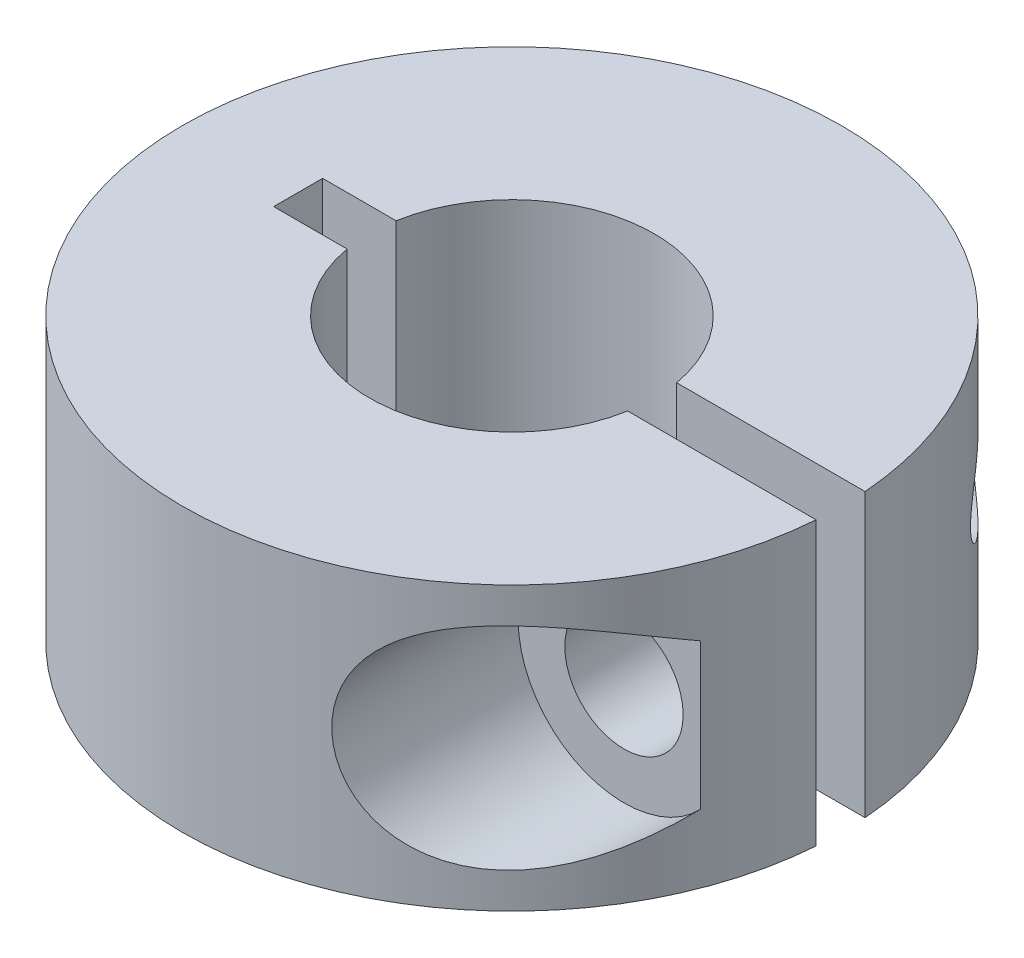
ISO-10303-21;
HEADER;
FILE_DESCRIPTION(('STEP AP214'),'2;1');
FILE_NAME('part.step','',(''),(''),'','','');
FILE_SCHEMA(('AUTOMOTIVE_DESIGN { 1 0 10303 214 1 1 1 1 }'));
ENDSEC;
DATA;
#1=APPLICATION_CONTEXT('core data for automotive mechanical design processes');
#2=APPLICATION_PROTOCOL_DEFINITION('international standard','automotive_design',2000,#1);
#3=PRODUCT_CONTEXT('',#1,'mechanical');
#4=PRODUCT('Part','Part','',(#3));
#5=PRODUCT_RELATED_PRODUCT_CATEGORY('part','',(#4));
#6=PRODUCT_DEFINITION_FORMATION('','',#4);
#7=PRODUCT_DEFINITION_CONTEXT('part definition',#1,'design');
#8=PRODUCT_DEFINITION('design','',#6,#7);
#9=PRODUCT_DEFINITION_SHAPE('','',#8);
#10=(LENGTH_UNIT() NAMED_UNIT(*) SI_UNIT(.MILLI.,.METRE.));
#11=(NAMED_UNIT(*) PLANE_ANGLE_UNIT() SI_UNIT($,.RADIAN.));
#12=(NAMED_UNIT(*) SI_UNIT($,.STERADIAN.) SOLID_ANGLE_UNIT());
#13=UNCERTAINTY_MEASURE_WITH_UNIT(LENGTH_MEASURE(1.E-05),#10,'distance_accuracy_value','');
#14=(GEOMETRIC_REPRESENTATION_CONTEXT(3) GLOBAL_UNCERTAINTY_ASSIGNED_CONTEXT((#13)) GLOBAL_UNIT_ASSIGNED_CONTEXT((#10,
#11,#12)) REPRESENTATION_CONTEXT('',''));
#15=CARTESIAN_POINT('',(0.,0.,0.));
#16=DIRECTION('',(0.,0.,1.));
#17=DIRECTION('',(1.,0.,0.));
#18=AXIS2_PLACEMENT_3D('',#15,#16,#17);
#19=CARTESIAN_POINT('',(7.77979615405373,4.7625,51.6255));
#20=DIRECTION('',(0.,0.,-1.));
#21=DIRECTION('',(-1.,0.,0.));
#22=AXIS2_PLACEMENT_3D('',#19,#20,#21);
#23=CYLINDRICAL_SURFACE('',#22,1.9939);
#24=CARTESIAN_POINT('',(7.77979615405373,4.7625,4.0005));
#25=DIRECTION('',(0.,0.,-1.));
#26=DIRECTION('',(-1.,0.,0.));
#27=AXIS2_PLACEMENT_3D('',#24,#25,#26);
#28=CIRCLE('',#27,1.9939);
#29=CARTESIAN_POINT('',(5.78589615405373,4.7625,4.0005));
#30=VERTEX_POINT('',#29);
#31=EDGE_CURVE('E20',#30,#30,#28,.F.);
#32=ORIENTED_EDGE('',*,*,#31,.T.);
#33=EDGE_LOOP('',(#32));
#34=FACE_BOUND('',#33,.T.);
#35=CARTESIAN_POINT('',(7.77979615405373,4.7625,0.8255));
#36=DIRECTION('',(0.,0.,-1.));
#37=DIRECTION('',(-1.,0.,0.));
#38=AXIS2_PLACEMENT_3D('',#35,#36,#37);
#39=CIRCLE('',#38,1.9939);
#40=CARTESIAN_POINT('',(5.78589615405373,4.7625,0.8255));
#41=VERTEX_POINT('',#40);
#42=EDGE_CURVE('E85',#41,#41,#39,.T.);
#43=ORIENTED_EDGE('',*,*,#42,.T.);
#44=EDGE_LOOP('',(#43));
#45=FACE_BOUND('',#44,.T.);
#46=ADVANCED_FACE('F17',(#34,#45),#23,.F.);
#47=CARTESIAN_POINT('',(-7.20620384594627,9.525,-0.8255));
#48=DIRECTION('',(-1.,0.,0.));
#49=DIRECTION('',(0.,0.,1.));
#50=AXIS2_PLACEMENT_3D('',#47,#48,#49);
#51=PLANE('',#50);
#52=DIRECTION('',(0.,1.,0.));
#53=VECTOR('',#52,1.);
#54=CARTESIAN_POINT('',(-7.20620384594627,9.525,-0.825500000000001));
#55=LINE('',#54,#53);
#56=CARTESIAN_POINT('',(-7.20620384594627,0.,-0.8255));
#57=VERTEX_POINT('',#56);
#58=CARTESIAN_POINT('',(-7.20620384594627,9.525,-0.8255));
#59=VERTEX_POINT('',#58);
#60=EDGE_CURVE('E102',#57,#59,#55,.T.);
#61=ORIENTED_EDGE('',*,*,#60,.T.);
#62=DIRECTION('',(0.,0.,1.));
#63=VECTOR('',#62,1.);
#64=CARTESIAN_POINT('',(-7.20620384594627,9.525,-0.8255));
#65=LINE('',#64,#63);
#66=CARTESIAN_POINT('',(-7.20620384594627,9.525,0.825499999999998));
#67=VERTEX_POINT('',#66);
#68=EDGE_CURVE('E128',#67,#59,#65,.F.);
#69=ORIENTED_EDGE('',*,*,#68,.F.);
#70=DIRECTION('',(0.,1.,0.));
#71=VECTOR('',#70,1.);
#72=CARTESIAN_POINT('',(-7.20620384594627,9.525,0.825499999999998));
#73=LINE('',#72,#71);
#74=CARTESIAN_POINT('',(-7.20620384594627,0.,0.825499999999998));
#75=VERTEX_POINT('',#74);
#76=EDGE_CURVE('E109',#67,#75,#73,.F.);
#77=ORIENTED_EDGE('',*,*,#76,.T.);
#78=DIRECTION('',(0.,0.,1.));
#79=VECTOR('',#78,1.);
#80=CARTESIAN_POINT('',(-7.20620384594627,0.,-0.8255));
#81=LINE('',#80,#79);
#82=EDGE_CURVE('E125',#57,#75,#81,.T.);
#83=ORIENTED_EDGE('',*,*,#82,.F.);
#84=EDGE_LOOP('',(#61,#69,#77,#83));
#85=FACE_BOUND('',#84,.T.);
#86=ADVANCED_FACE('F171',(#85),#51,.F.);
#87=CARTESIAN_POINT('',(7.77979615405373,4.7625,4.0005));
#88=DIRECTION('',(0.,0.,-1.));
#89=DIRECTION('',(-1.,0.,0.));
#90=AXIS2_PLACEMENT_3D('',#87,#88,#89);
#91=PLANE('',#90);
#92=DIRECTION('',(0.,-1.,0.));
#93=VECTOR('',#92,1.);
#94=CARTESIAN_POINT('',(10.3674324690349,9.525,4.0005));
#95=LINE('',#94,#93);
#96=CARTESIAN_POINT('',(10.3674324690349,7.22009190904235,4.0005));
#97=VERTEX_POINT('',#96);
#98=CARTESIAN_POINT('',(10.3674324690349,2.30490809095765,4.0005));
#99=VERTEX_POINT('',#98);
#100=EDGE_CURVE('E77',#97,#99,#95,.T.);
#101=ORIENTED_EDGE('',*,*,#100,.F.);
#102=CARTESIAN_POINT('',(7.77979615405373,4.7625,4.0005));
#103=DIRECTION('',(0.,0.,-1.));
#104=DIRECTION('',(-1.,0.,0.));
#105=AXIS2_PLACEMENT_3D('',#102,#103,#104);
#106=CIRCLE('',#105,3.5687);
#107=EDGE_CURVE('E79',#97,#99,#106,.F.);
#108=ORIENTED_EDGE('',*,*,#107,.T.);
#109=EDGE_LOOP('',(#101,#108));
#110=FACE_BOUND('',#109,.T.);
#111=ORIENTED_EDGE('',*,*,#31,.F.);
#112=EDGE_LOOP('',(#111));
#113=FACE_BOUND('',#112,.T.);
#114=ADVANCED_FACE('F81',(#110,#113),#91,.F.);
#115=CARTESIAN_POINT('',(7.77979615405373,4.7625,11.1125));
#116=DIRECTION('',(0.,0.,-1.));
#117=DIRECTION('',(-1.,0.,0.));
#118=AXIS2_PLACEMENT_3D('',#115,#116,#117);
#119=CYLINDRICAL_SURFACE('',#118,3.5687);
#120=CARTESIAN_POINT('',(10.3674324690349,2.30490809095765,4.0005));
#121=CARTESIAN_POINT('',(10.2663669239335,2.19847959541599,4.26230224821174));
#122=CARTESIAN_POINT('',(10.1550425392723,2.09444652602234,4.52137700738966));
#123=CARTESIAN_POINT('',(9.91083423240438,1.89558467643553,5.03431334383161));
#124=CARTESIAN_POINT('',(9.7778592183075,1.8007976161063,5.2881475535187));
#125=CARTESIAN_POINT('',(9.48799793007862,1.62452313443331,5.79234836702928));
#126=CARTESIAN_POINT('',(9.33078063634742,1.54325837689086,6.042604576959));
#127=CARTESIAN_POINT('',(8.99395347939697,1.40173632453196,6.53335445131245));
#128=CARTESIAN_POINT('',(8.81439006664557,1.34143640914698,6.77386703363101));
#129=CARTESIAN_POINT('',(8.52916651119161,1.27200319506489,7.12485875216284));
#130=CARTESIAN_POINT('',(8.43167972628431,1.25238202422405,7.23998139033188));
#131=CARTESIAN_POINT('',(8.23150314272245,1.22105313992744,7.46678445643854));
#132=CARTESIAN_POINT('',(8.1288130467734,1.20934587918725,7.57846468710437));
#133=CARTESIAN_POINT('',(7.91905409389861,1.19497531618115,7.79737953687186));
#134=CARTESIAN_POINT('',(7.81200495166688,1.19227506955817,7.90463052966583));
#135=CARTESIAN_POINT('',(7.59371464897207,1.19698376693025,8.11455885658455));
#136=CARTESIAN_POINT('',(7.48247425347248,1.20439087479674,8.21723701792306));
#137=CARTESIAN_POINT('',(7.27484741086238,1.22841788622605,8.40120666156685));
#138=CARTESIAN_POINT('',(7.17895742835564,1.24336004979494,8.48327737734031));
#139=CARTESIAN_POINT('',(6.98549160847407,1.28192181193209,8.64328119369291));
#140=CARTESIAN_POINT('',(6.88791613303347,1.30553956908936,8.72121516828857));
#141=CARTESIAN_POINT('',(6.69192650438771,1.36212348411486,8.87249106272569));
#142=CARTESIAN_POINT('',(6.5935124940477,1.3950880792322,8.94583374771056));
#143=CARTESIAN_POINT('',(6.39688046982801,1.47095603467606,9.08747753024267));
#144=CARTESIAN_POINT('',(6.29866242359396,1.513857588604,9.15577954114102));
#145=CARTESIAN_POINT('',(6.12046763513868,1.60174888476471,9.27561321156923));
#146=CARTESIAN_POINT('',(6.04026323206984,1.64510575470385,9.3280069229299));
#147=CARTESIAN_POINT('',(5.88163789457942,1.73907332052905,9.42882912499201));
#148=CARTESIAN_POINT('',(5.80321664489981,1.78968272244453,9.47725832061136));
#149=CARTESIAN_POINT('',(5.64900919954521,1.89819302718989,9.56997634046226));
#150=CARTESIAN_POINT('',(5.57322292596697,1.95609371421807,9.61426528716605));
#151=CARTESIAN_POINT('',(5.4252198105476,2.07906172069284,9.69855124417801));
#152=CARTESIAN_POINT('',(5.35300129595211,2.14412563454233,9.73855027632651));
#153=CARTESIAN_POINT('',(5.21265818259072,2.28154951917683,9.81438978299457));
#154=CARTESIAN_POINT('',(5.14455599507122,2.35394453145642,9.85020833585232));
#155=CARTESIAN_POINT('',(5.01378027806257,2.50533880258088,9.91741239005637));
#156=CARTESIAN_POINT('',(4.95110451871958,2.5843353222254,9.94879971567963));
#157=CARTESIAN_POINT('',(4.83197655089795,2.7484818722511,10.0072006298196));
#158=CARTESIAN_POINT('',(4.77552784937671,2.83363532586194,10.0342117577197));
#159=CARTESIAN_POINT('',(4.66968255156178,3.00940695388714,10.0839050896206));
#160=CARTESIAN_POINT('',(4.62028522054457,3.10002455755817,10.1065877447134));
#161=CARTESIAN_POINT('',(4.53305156514435,3.27816052527519,10.1459940207608));
#162=CARTESIAN_POINT('',(4.4945925743953,3.36529949525515,10.1630582106346));
#163=CARTESIAN_POINT('',(4.42460442827421,3.54290304454181,10.1937232105687));
#164=CARTESIAN_POINT('',(4.39307478789183,3.63336739057569,10.2073242630371));
#165=CARTESIAN_POINT('',(4.33735537673633,3.81677762480408,10.2311251434094));
#166=CARTESIAN_POINT('',(4.31315211523552,3.90971860477992,10.2413312262512));
#167=CARTESIAN_POINT('',(4.27228604299165,4.0975025392839,10.2584462513805));
#168=CARTESIAN_POINT('',(4.25561994490492,4.19234464574727,10.2653566311652));
#169=CARTESIAN_POINT('',(4.23226471995796,4.36636343023717,10.2750047277462));
#170=CARTESIAN_POINT('',(4.22433286345768,4.44534623447247,10.2782640608988));
#171=CARTESIAN_POINT('',(4.21374608112229,4.60370610770911,10.2826077289471));
#172=CARTESIAN_POINT('',(4.21109112844074,4.68308317470257,10.2836920749081));
#173=CARTESIAN_POINT('',(4.21110795467778,4.94897836640286,10.2836925209088));
#174=CARTESIAN_POINT('',(4.22578569721786,5.13567594248044,10.2777149649096));
#175=CARTESIAN_POINT('',(4.28397599741145,5.50393941773717,10.2535923667797));
#176=CARTESIAN_POINT('',(4.32754043196438,5.68549547060415,10.2354254333466));
#177=CARTESIAN_POINT('',(4.44165490623085,6.03791028227731,10.1864216470968));
#178=CARTESIAN_POINT('',(4.51217532606613,6.20878054393041,10.1555986982627));
#179=CARTESIAN_POINT('',(4.67714722696151,6.535247570976,10.0806800129494));
#180=CARTESIAN_POINT('',(4.771587674735,6.69085133236821,10.03659039406));
#181=CARTESIAN_POINT('',(4.98130360475947,6.98441429175627,9.93418167292039));
#182=CARTESIAN_POINT('',(5.09676685797358,7.12219359415009,9.87573252197954));
#183=CARTESIAN_POINT('',(5.34291515503719,7.37563229639414,9.74475841110709));
#184=CARTESIAN_POINT('',(5.47360279054515,7.49128792123418,9.67223105322721));
#185=CARTESIAN_POINT('',(5.75187719093284,7.70451693085491,9.50951251052659));
#186=CARTESIAN_POINT('',(5.89998752702557,7.8008533576798,9.41860434778593));
#187=CARTESIAN_POINT('',(6.20144537979583,7.96783244118789,9.22290703360076));
#188=CARTESIAN_POINT('',(6.35479572215133,8.03846098783399,9.11811030218263));
#189=CARTESIAN_POINT('',(6.61464262506999,8.13756072006862,8.93036839954114));
#190=CARTESIAN_POINT('',(6.72109839524481,8.17231824265645,8.85056642852618));
#191=CARTESIAN_POINT('',(6.93291796581742,8.2309997980135,8.68563789853114));
#192=CARTESIAN_POINT('',(7.03828142208256,8.25492051227578,8.60050971760008));
#193=CARTESIAN_POINT('',(7.24692582861338,8.29278705004218,8.42545512554879));
#194=CARTESIAN_POINT('',(7.35020473617683,8.30672351095785,8.33552429548874));
#195=CARTESIAN_POINT('',(7.55381938185991,8.32550584447609,8.15146118083268));
#196=CARTESIAN_POINT('',(7.65415427968448,8.33034914603401,8.05732771566287));
#197=CARTESIAN_POINT('',(7.89029287987062,8.33214149466807,7.82737352779086));
#198=CARTESIAN_POINT('',(8.02442243549549,8.32520873112519,7.68979558622367));
#199=CARTESIAN_POINT('',(8.28473874045248,8.29772232559945,7.40861117656735));
#200=CARTESIAN_POINT('',(8.41092206999899,8.27716286242626,7.26500215662964));
#201=CARTESIAN_POINT('',(8.65521331719172,8.22442705946524,6.97219028142885));
#202=CARTESIAN_POINT('',(8.77328753514642,8.19220536465628,6.82296765331261));
#203=CARTESIAN_POINT('',(9.00051785282219,8.11805359850228,6.52028783506779));
#204=CARTESIAN_POINT('',(9.10967518427914,8.07612487111847,6.36683123373096));
#205=CARTESIAN_POINT('',(9.33399320618012,7.97764616263796,6.03407352995808));
#206=CARTESIAN_POINT('',(9.44778095845141,7.91986281999941,5.85421416860254));
#207=CARTESIAN_POINT('',(9.66374959882742,7.79595404338297,5.49038916371615));
#208=CARTESIAN_POINT('',(9.76592600628248,7.72982540971263,5.30642196757501));
#209=CARTESIAN_POINT('',(9.95763815605561,7.59205473634197,4.93719299017159));
#210=CARTESIAN_POINT('',(10.0473122671133,7.52048935423043,4.75197402105144));
#211=CARTESIAN_POINT('',(10.2155862178225,7.37306629497145,4.37850078748289));
#212=CARTESIAN_POINT('',(10.2941977253124,7.29721326026375,4.19024995796826));
#213=CARTESIAN_POINT('',(10.3674324690349,7.22009190904235,4.0005));
#214=B_SPLINE_CURVE_WITH_KNOTS('',3,(#120,#121,#122,#123,#124,#125,#126,#127,#128,#129,#130,
#131,#132,#133,#134,#135,#136,#137,#138,#139,#140,#141,#142,#143,#144,#145,#146,#147,#148,#149,
#150,#151,#152,#153,#154,#155,#156,#157,#158,#159,#160,#161,#162,#163,#164,#165,#166,#167,#168,
#169,#170,#171,#172,#173,#174,#175,#176,#177,#178,#179,#180,#181,#182,#183,#184,#185,#186,#187,
#188,#189,#190,#191,#192,#193,#194,#195,#196,#197,#198,#199,#200,#201,#202,#203,#204,#205,#206,
#207,#208,#209,#210,#211,#212,#213),.UNSPECIFIED.,.F.,.F.,(4,2,2,2,2,2,2,2,2,2,2,2,2,2,2,2,2,2,
2,2,2,2,2,2,2,2,2,2,2,2,2,2,2,2,2,2,2,2,2,2,2,2,2,2,2,2,4),(0.,0.900564757805945,
1.80502136618994,2.72314796339463,3.63939698466883,4.09549870479075,4.55162651402446,
5.00588109345266,5.46005316278619,5.84100641610331,6.22187885805555,6.60268765729432,
6.98342728513403,7.29857796486122,7.61367248638466,7.9287576841804,8.24369372337746,
8.56021334571762,8.8766022787887,9.19316849592317,9.50970170405786,9.79963744700581,
10.0895528898323,10.378931191199,10.6681831578316,10.9063127947884,11.1444412202491,
11.7035897332714,12.2637451368956,12.8232867896403,13.3825708182631,13.9471199344566,
14.5117652951076,15.1054705931551,15.6995012628969,16.1115195263262,16.5236638751068,
16.9361942021713,17.3488411525354,17.9247618490849,18.5009287319273,19.079360867783,
19.657712966208,20.3187524451641,20.9800461496471,21.6333137153044,22.2858870245931),.UNSPECIFIED.);
#215=EDGE_CURVE('E86',#99,#97,#214,.T.);
#216=ORIENTED_EDGE('',*,*,#215,.F.);
#217=ORIENTED_EDGE('',*,*,#107,.F.);
#218=EDGE_LOOP('',(#216,#217));
#219=FACE_BOUND('',#218,.T.);
#220=ADVANCED_FACE('F87',(#219),#119,.F.);
#221=CARTESIAN_POINT('',(7.77979615405373,4.7625,-0.8255));
#222=DIRECTION('',(0.,0.,1.));
#223=DIRECTION('',(1.,0.,0.));
#224=AXIS2_PLACEMENT_3D('',#221,#222,#223);
#225=CYLINDRICAL_SURFACE('',#224,1.35255);
#226=CARTESIAN_POINT('',(7.77979615405373,4.7625,-0.8255));
#227=DIRECTION('',(0.,0.,1.));
#228=DIRECTION('',(1.,0.,0.));
#229=AXIS2_PLACEMENT_3D('',#226,#227,#228);
#230=CIRCLE('',#229,1.35255);
#231=CARTESIAN_POINT('',(9.13234615405373,4.7625,-0.8255));
#232=VERTEX_POINT('',#231);
#233=EDGE_CURVE('E94',#232,#232,#230,.T.);
#234=ORIENTED_EDGE('',*,*,#233,.T.);
#235=EDGE_LOOP('',(#234));
#236=FACE_BOUND('',#235,.T.);
#237=CARTESIAN_POINT('',(6.42724615405373,4.7625,-9.06521721334914));
#238=CARTESIAN_POINT('',(6.42725051386567,4.69729349686207,-9.06521484293327));
#239=CARTESIAN_POINT('',(6.43199350127272,4.63202157832079,-9.06185711492394));
#240=CARTESIAN_POINT('',(6.45069191620245,4.50344595016543,-9.04855539866578));
#241=CARTESIAN_POINT('',(6.46466183296176,4.44014550036516,-9.0386010515284));
#242=CARTESIAN_POINT('',(6.50092320383923,4.31759160728634,-9.01255485878856));
#243=CARTESIAN_POINT('',(6.52318363929626,4.25832404064418,-8.9964858860175));
#244=CARTESIAN_POINT('',(6.57484760370806,4.14494375784632,-8.95879753024897));
#245=CARTESIAN_POINT('',(6.60425040670855,4.09083051857953,-8.93717871132833));
#246=CARTESIAN_POINT('',(6.67063488166069,3.98582881279454,-8.88774904651376));
#247=CARTESIAN_POINT('',(6.70794211744733,3.93527651174348,-8.85966508072131));
#248=CARTESIAN_POINT('',(6.78747920384551,3.8413630691107,-8.79888039649585));
#249=CARTESIAN_POINT('',(6.82971175743175,3.7980059080863,-8.76617714093555));
#250=CARTESIAN_POINT('',(6.93676010891622,3.70142298187185,-8.68190118433547));
#251=CARTESIAN_POINT('',(7.00344470181075,3.65203648929477,-8.62828384778057));
#252=CARTESIAN_POINT('',(7.14073644849573,3.56771355341513,-8.51501702408386));
#253=CARTESIAN_POINT('',(7.21135127376822,3.53280658097599,-8.45535553892394));
#254=CARTESIAN_POINT('',(7.37551318943355,3.4679311015023,-8.31291183464742));
#255=CARTESIAN_POINT('',(7.46955496557129,3.44262512131705,-8.22858230365518));
#256=CARTESIAN_POINT('',(7.65631122374983,3.41227231491982,-8.0551149771241));
#257=CARTESIAN_POINT('',(7.74902468780618,3.40724027675367,-7.96597371986675));
#258=CARTESIAN_POINT('',(7.93260916798154,3.41541354573241,-7.78321643189271));
#259=CARTESIAN_POINT('',(8.02341005844468,3.4289728153589,-7.68954723625733));
#260=CARTESIAN_POINT('',(8.19968317388684,3.47356030219008,-7.50130102913478));
#261=CARTESIAN_POINT('',(8.28515152044056,3.50460107311566,-7.40672341332664));
#262=CARTESIAN_POINT('',(8.44942044766132,3.58380523644829,-7.2187586651293));
#263=CARTESIAN_POINT('',(8.52821995893403,3.63197136861001,-7.12537172570496));
#264=CARTESIAN_POINT('',(8.63998573409417,3.71767615784216,-6.98869036675427));
#265=CARTESIAN_POINT('',(8.67615377407723,3.74846998189495,-6.94371607978802));
#266=CARTESIAN_POINT('',(8.74605600129952,3.81484141376245,-6.85545895202343));
#267=CARTESIAN_POINT('',(8.77979173706973,3.85041593586811,-6.81217504323436));
#268=CARTESIAN_POINT('',(8.84822446653481,3.93124697101413,-6.72310139290578));
#269=CARTESIAN_POINT('',(8.88256560367972,3.97715053621501,-6.67761815116879));
#270=CARTESIAN_POINT('',(8.94671882683973,4.07609415299266,-6.59141503649058));
#271=CARTESIAN_POINT('',(8.97653613143118,4.12912584642951,-6.55068968763795));
#272=CARTESIAN_POINT('',(9.02413858316114,4.2301630108557,-6.48489372352669));
#273=CARTESIAN_POINT('',(9.04312288963765,4.27663441520166,-6.45835974793269));
#274=CARTESIAN_POINT('',(9.07642350940675,4.3741796244611,-6.41147565479932));
#275=CARTESIAN_POINT('',(9.09074655481073,4.42524665465929,-6.39111662190494));
#276=CARTESIAN_POINT('',(9.11189317766656,4.52362204236662,-6.36092392853074));
#277=CARTESIAN_POINT('',(9.11949729227643,4.5704204080861,-6.35000007263481));
#278=CARTESIAN_POINT('',(9.12972046055373,4.66564881286231,-6.33529363301747));
#279=CARTESIAN_POINT('',(9.13234539300947,4.71407685892571,-6.33150262777137));
#280=CARTESIAN_POINT('',(9.13234687992863,4.80868541243554,-6.33150022809278));
#281=CARTESIAN_POINT('',(9.12996036660318,4.85486636274554,-6.33494666079501));
#282=CARTESIAN_POINT('',(9.12064861883045,4.94580601817767,-6.34834536910189));
#283=CARTESIAN_POINT('',(9.11371948751219,4.99056346755802,-6.35830323049691));
#284=CARTESIAN_POINT('',(9.09379705823402,5.08776384714079,-6.38677336002351));
#285=CARTESIAN_POINT('',(9.07976560932048,5.13956124776633,-6.40674010172869));
#286=CARTESIAN_POINT('',(9.04688637252221,5.23853352341446,-6.45308543877553));
#287=CARTESIAN_POINT('',(9.02802941255758,5.28569935609753,-6.47947623992327));
#288=CARTESIAN_POINT('',(8.97595077793867,5.3982563011822,-6.55154951354417));
#289=CARTESIAN_POINT('',(8.94031787518741,5.46061289369762,-6.60019071418336));
#290=CARTESIAN_POINT('',(8.86293577562621,5.57552900808703,-6.70374797266251));
#291=CARTESIAN_POINT('',(8.82117162335175,5.62806383913803,-6.75867929929566));
#292=CARTESIAN_POINT('',(8.74241168181125,5.71401790113332,-6.86010913097727));
#293=CARTESIAN_POINT('',(8.7063080195638,5.74912200450601,-6.90589671041646));
#294=CARTESIAN_POINT('',(8.63161664693339,5.81428424408298,-6.99903023188608));
#295=CARTESIAN_POINT('',(8.59302759569435,5.84433962443868,-7.04637700825023));
#296=CARTESIAN_POINT('',(8.47397082553645,5.92735869840442,-7.18991430882344));
#297=CARTESIAN_POINT('',(8.39021900051359,5.97316951776947,-7.28759464730287));
#298=CARTESIAN_POINT('',(8.21261217241913,6.0476731300518,-7.48727082827017));
#299=CARTESIAN_POINT('',(8.11849707570559,6.07566491749505,-7.58929191547064));
#300=CARTESIAN_POINT('',(7.92461045601931,6.11087205771957,-7.7915183956985));
#301=CARTESIAN_POINT('',(7.82484377910654,6.11810494367569,-7.89172524990992));
#302=CARTESIAN_POINT('',(7.63692594535757,6.11026691567303,-8.07338417519062));
#303=CARTESIAN_POINT('',(7.54922180102864,6.09831681045188,-8.15542865362084));
#304=CARTESIAN_POINT('',(7.37367944859783,6.0557877055756,-8.31447248364704));
#305=CARTESIAN_POINT('',(7.2858415242481,6.02523089222949,-8.39147772302125));
#306=CARTESIAN_POINT('',(7.13332888129076,5.95282456598946,-8.52120378744527));
#307=CARTESIAN_POINT('',(7.06796070483867,5.91517033115231,-8.57544454464142));
#308=CARTESIAN_POINT('',(6.94157826185632,5.82678720074208,-8.67806069428922));
#309=CARTESIAN_POINT('',(6.88055819444334,5.77607615783651,-8.726443963957));
#310=CARTESIAN_POINT('',(6.77641578746445,5.67189815713617,-8.80746188663116));
#311=CARTESIAN_POINT('',(6.73206430826271,5.62064641304644,-8.84135705377025));
#312=CARTESIAN_POINT('',(6.65020865381225,5.50960947750958,-8.90308983462969));
#313=CARTESIAN_POINT('',(6.6127050245321,5.44982360632608,-8.93092696538601));
#314=CARTESIAN_POINT('',(6.54640578590612,5.32227500006421,-8.97964052869189));
#315=CARTESIAN_POINT('',(6.51768312193646,5.25445161270734,-9.00045879313075));
#316=CARTESIAN_POINT('',(6.47142187614467,5.11325898109175,-9.03378020536473));
#317=CARTESIAN_POINT('',(6.45385452482184,5.03990455311158,-9.04630474624163));
#318=CARTESIAN_POINT('',(6.43745576965828,4.93181050820827,-9.05797162818181));
#319=CARTESIAN_POINT('',(6.4336352609791,4.89812573919876,-9.06068446573048));
#320=CARTESIAN_POINT('',(6.42852934971693,4.83046656739526,-9.06430785275542));
#321=CARTESIAN_POINT('',(6.42724388128229,4.79649217214779,-9.06521844904773));
#322=CARTESIAN_POINT('',(6.42724615405373,4.7625,-9.06521721334914));
#323=B_SPLINE_CURVE_WITH_KNOTS('',3,(#237,#238,#239,#240,#241,#242,#243,#244,#245,#246,#247,
#248,#249,#250,#251,#252,#253,#254,#255,#256,#257,#258,#259,#260,#261,#262,#263,#264,#265,#266,
#267,#268,#269,#270,#271,#272,#273,#274,#275,#276,#277,#278,#279,#280,#281,#282,#283,#284,#285,
#286,#287,#288,#289,#290,#291,#292,#293,#294,#295,#296,#297,#298,#299,#300,#301,#302,#303,#304,
#305,#306,#307,#308,#309,#310,#311,#312,#313,#314,#315,#316,#317,#318,#319,#320,#321,#322),
.UNSPECIFIED.,.T.,.F.,(4,2,2,2,2,2,2,2,2,2,2,2,2,2,2,2,2,2,2,2,2,2,2,2,2,2,2,2,2,2,2,2,2,2,2,2,
2,2,2,2,2,2,4),(0.,0.19548098576599,0.39126967149432,0.586333062397315,0.781376635236253,
0.987043357780296,1.19282348444301,1.48758278192446,1.78293910778627,2.16735056196091,
2.55204235955131,2.94416094901911,3.3365614842735,3.7290248249359,3.92507847308448,
4.12100618049771,4.3400407196027,4.55882063286583,4.72860526719673,4.89814358734956,
5.04338778730525,5.18846039428849,5.32682891062122,5.46531628155807,5.6361384888282,
5.80728782949306,6.06607486898029,6.32550397097796,6.52941671812134,6.73344041200314,
7.14151964298149,7.56479572302537,7.98771419452043,8.34849623051461,8.70884891650827,
8.98658368317371,9.26394069928591,9.49037741669735,9.71683217968527,9.94512000594052,
10.1728166618353,10.2747236130821,10.376627917101),.UNSPECIFIED.);
#324=CARTESIAN_POINT('',(6.42724615405373,4.7625,-9.06521721334914));
#325=VERTEX_POINT('',#324);
#326=EDGE_CURVE('E123',#325,#325,#323,.T.);
#327=ORIENTED_EDGE('',*,*,#326,.F.);
#328=EDGE_LOOP('',(#327));
#329=FACE_BOUND('',#328,.T.);
#330=ADVANCED_FACE('F151',(#236,#329),#225,.F.);
#331=CARTESIAN_POINT('',(4.69041106940533,9.525,0.825499999999997));
#332=DIRECTION('',(0.,0.,1.));
#333=DIRECTION('',(1.,0.,0.));
#334=AXIS2_PLACEMENT_3D('',#331,#332,#333);
#335=PLANE('',#334);
#336=DIRECTION('',(0.,1.,0.));
#337=VECTOR('',#336,1.);
#338=CARTESIAN_POINT('',(4.72909189062763,0.,0.825499999999998));
#339=LINE('',#338,#337);
#340=CARTESIAN_POINT('',(4.72909189062763,0.,0.825499999999998));
#341=VERTEX_POINT('',#340);
#342=CARTESIAN_POINT('',(4.72909189062763,9.525,0.825499999999998));
#343=VERTEX_POINT('',#342);
#344=EDGE_CURVE('E112',#341,#343,#339,.T.);
#345=ORIENTED_EDGE('',*,*,#344,.T.);
#346=DIRECTION('',(1.,0.,0.));
#347=VECTOR('',#346,1.);
#348=CARTESIAN_POINT('',(0.,9.525,0.825499999999998));
#349=LINE('',#348,#347);
#350=CARTESIAN_POINT('',(11.0817961540537,9.525,0.825499999999998));
#351=VERTEX_POINT('',#350);
#352=EDGE_CURVE('E202',#351,#343,#349,.F.);
#353=ORIENTED_EDGE('',*,*,#352,.F.);
#354=DIRECTION('',(0.,-1.,0.));
#355=VECTOR('',#354,1.);
#356=CARTESIAN_POINT('',(11.0817961540537,9.525,0.825499999999999));
#357=LINE('',#356,#355);
#358=CARTESIAN_POINT('',(11.0817961540537,0.,0.825499999999998));
#359=VERTEX_POINT('',#358);
#360=EDGE_CURVE('E89',#359,#351,#357,.F.);
#361=ORIENTED_EDGE('',*,*,#360,.F.);
#362=DIRECTION('',(1.,0.,0.));
#363=VECTOR('',#362,1.);
#364=CARTESIAN_POINT('',(0.,0.,0.825499999999998));
#365=LINE('',#364,#363);
#366=EDGE_CURVE('E142',#359,#341,#365,.F.);
#367=ORIENTED_EDGE('',*,*,#366,.T.);
#368=EDGE_LOOP('',(#345,#353,#361,#367));
#369=FACE_BOUND('',#368,.T.);
#370=ORIENTED_EDGE('',*,*,#42,.F.);
#371=EDGE_LOOP('',(#370));
#372=FACE_BOUND('',#371,.T.);
#373=ADVANCED_FACE('F221',(#369,#372),#335,.F.);
#374=CARTESIAN_POINT('',(0.,0.,0.));
#375=DIRECTION('',(0.,1.,0.));
#376=DIRECTION('',(0.,0.,1.));
#377=AXIS2_PLACEMENT_3D('',#374,#375,#376);
#378=CYLINDRICAL_SURFACE('',#377,4.8006);
#379=CARTESIAN_POINT('',(0.,0.,0.));
#380=DIRECTION('',(0.,1.,0.));
#381=DIRECTION('',(0.,0.,1.));
#382=AXIS2_PLACEMENT_3D('',#379,#380,#381);
#383=CIRCLE('',#382,4.8006);
#384=CARTESIAN_POINT('',(-4.72909189062763,0.,0.825499999999997));
#385=VERTEX_POINT('',#384);
#386=EDGE_CURVE('E139',#341,#385,#383,.F.);
#387=ORIENTED_EDGE('',*,*,#386,.T.);
#388=DIRECTION('',(0.,1.,0.));
#389=VECTOR('',#388,1.);
#390=CARTESIAN_POINT('',(-4.72909189062763,9.525,0.825499999999997));
#391=LINE('',#390,#389);
#392=CARTESIAN_POINT('',(-4.72909189062763,9.525,0.825499999999997));
#393=VERTEX_POINT('',#392);
#394=EDGE_CURVE('E105',#385,#393,#391,.T.);
#395=ORIENTED_EDGE('',*,*,#394,.T.);
#396=CARTESIAN_POINT('',(0.,9.525,0.));
#397=DIRECTION('',(0.,1.,0.));
#398=DIRECTION('',(0.,0.,1.));
#399=AXIS2_PLACEMENT_3D('',#396,#397,#398);
#400=CIRCLE('',#399,4.8006);
#401=EDGE_CURVE('E149',#343,#393,#400,.F.);
#402=ORIENTED_EDGE('',*,*,#401,.F.);
#403=ORIENTED_EDGE('',*,*,#344,.F.);
#404=EDGE_LOOP('',(#387,#395,#402,#403));
#405=FACE_BOUND('',#404,.T.);
#406=ADVANCED_FACE('F225',(#405),#378,.F.);
#407=CARTESIAN_POINT('',(-4.69041106940533,9.525,0.825499999999997));
#408=DIRECTION('',(0.,0.,1.));
#409=DIRECTION('',(1.,0.,0.));
#410=AXIS2_PLACEMENT_3D('',#407,#408,#409);
#411=PLANE('',#410);
#412=ORIENTED_EDGE('',*,*,#394,.F.);
#413=DIRECTION('',(1.,0.,0.));
#414=VECTOR('',#413,1.);
#415=CARTESIAN_POINT('',(0.,0.,0.825499999999997));
#416=LINE('',#415,#414);
#417=EDGE_CURVE('E141',#385,#75,#416,.F.);
#418=ORIENTED_EDGE('',*,*,#417,.T.);
#419=ORIENTED_EDGE('',*,*,#76,.F.);
#420=DIRECTION('',(1.,0.,0.));
#421=VECTOR('',#420,1.);
#422=CARTESIAN_POINT('',(0.,9.525,0.825499999999997));
#423=LINE('',#422,#421);
#424=EDGE_CURVE('E192',#393,#67,#423,.F.);
#425=ORIENTED_EDGE('',*,*,#424,.F.);
#426=EDGE_LOOP('',(#412,#418,#419,#425));
#427=FACE_BOUND('',#426,.T.);
#428=ADVANCED_FACE('F229',(#427),#411,.F.);
#429=CARTESIAN_POINT('',(-4.69041106940532,9.525,-0.825500000000001));
#430=DIRECTION('',(0.,0.,-1.));
#431=DIRECTION('',(-1.,0.,0.));
#432=AXIS2_PLACEMENT_3D('',#429,#430,#431);
#433=PLANE('',#432);
#434=DIRECTION('',(0.,1.,0.));
#435=VECTOR('',#434,1.);
#436=CARTESIAN_POINT('',(-4.72909189062763,0.,-0.825500000000004));
#437=LINE('',#436,#435);
#438=CARTESIAN_POINT('',(-4.72909189062763,0.,-0.825500000000002));
#439=VERTEX_POINT('',#438);
#440=CARTESIAN_POINT('',(-4.72909189062763,9.525,-0.825500000000002));
#441=VERTEX_POINT('',#440);
#442=EDGE_CURVE('E100',#439,#441,#437,.T.);
#443=ORIENTED_EDGE('',*,*,#442,.T.);
#444=DIRECTION('',(1.,0.,0.));
#445=VECTOR('',#444,1.);
#446=CARTESIAN_POINT('',(0.,9.525,-0.8255));
#447=LINE('',#446,#445);
#448=EDGE_CURVE('E124',#59,#441,#447,.T.);
#449=ORIENTED_EDGE('',*,*,#448,.F.);
#450=ORIENTED_EDGE('',*,*,#60,.F.);
#451=DIRECTION('',(1.,0.,0.));
#452=VECTOR('',#451,1.);
#453=CARTESIAN_POINT('',(0.,0.,-0.8255));
#454=LINE('',#453,#452);
#455=EDGE_CURVE('E138',#57,#439,#454,.T.);
#456=ORIENTED_EDGE('',*,*,#455,.T.);
#457=EDGE_LOOP('',(#443,#449,#450,#456));
#458=FACE_BOUND('',#457,.T.);
#459=ADVANCED_FACE('F188',(#458),#433,.F.);
#460=CARTESIAN_POINT('',(0.,0.,0.));
#461=DIRECTION('',(0.,1.,0.));
#462=DIRECTION('',(0.,0.,1.));
#463=AXIS2_PLACEMENT_3D('',#460,#461,#462);
#464=CYLINDRICAL_SURFACE('',#463,4.8006);
#465=DIRECTION('',(0.,1.,0.));
#466=VECTOR('',#465,1.);
#467=CARTESIAN_POINT('',(4.72909189062763,9.525,-0.825500000000001));
#468=LINE('',#467,#466);
#469=CARTESIAN_POINT('',(4.72909189062763,0.,-0.825500000000001));
#470=VERTEX_POINT('',#469);
#471=CARTESIAN_POINT('',(4.72909189062763,9.525,-0.825500000000001));
#472=VERTEX_POINT('',#471);
#473=EDGE_CURVE('E92',#470,#472,#468,.T.);
#474=ORIENTED_EDGE('',*,*,#473,.T.);
#475=CARTESIAN_POINT('',(0.,9.525,0.));
#476=DIRECTION('',(0.,1.,0.));
#477=DIRECTION('',(0.,0.,1.));
#478=AXIS2_PLACEMENT_3D('',#475,#476,#477);
#479=CIRCLE('',#478,4.8006);
#480=EDGE_CURVE('E119',#441,#472,#479,.F.);
#481=ORIENTED_EDGE('',*,*,#480,.F.);
#482=ORIENTED_EDGE('',*,*,#442,.F.);
#483=CARTESIAN_POINT('',(0.,0.,0.));
#484=DIRECTION('',(0.,1.,0.));
#485=DIRECTION('',(0.,0.,1.));
#486=AXIS2_PLACEMENT_3D('',#483,#484,#485);
#487=CIRCLE('',#486,4.8006);
#488=EDGE_CURVE('E35',#439,#470,#487,.F.);
#489=ORIENTED_EDGE('',*,*,#488,.T.);
#490=EDGE_LOOP('',(#474,#481,#482,#489));
#491=FACE_BOUND('',#490,.T.);
#492=ADVANCED_FACE('F210',(#491),#464,.F.);
#493=CARTESIAN_POINT('',(4.69041106940532,9.525,-0.825500000000001));
#494=DIRECTION('',(0.,0.,-1.));
#495=DIRECTION('',(-1.,0.,0.));
#496=AXIS2_PLACEMENT_3D('',#493,#494,#495);
#497=PLANE('',#496);
#498=ORIENTED_EDGE('',*,*,#473,.F.);
#499=DIRECTION('',(1.,0.,0.));
#500=VECTOR('',#499,1.);
#501=CARTESIAN_POINT('',(0.,0.,-0.8255));
#502=LINE('',#501,#500);
#503=CARTESIAN_POINT('',(11.0817961540537,0.,-0.825500000000001));
#504=VERTEX_POINT('',#503);
#505=EDGE_CURVE('E136',#470,#504,#502,.T.);
#506=ORIENTED_EDGE('',*,*,#505,.T.);
#507=DIRECTION('',(0.,-1.,0.));
#508=VECTOR('',#507,1.);
#509=CARTESIAN_POINT('',(11.0817961540537,9.525,-0.825500000000002));
#510=LINE('',#509,#508);
#511=CARTESIAN_POINT('',(11.0817961540537,9.525,-0.825500000000001));
#512=VERTEX_POINT('',#511);
#513=EDGE_CURVE('E120',#512,#504,#510,.T.);
#514=ORIENTED_EDGE('',*,*,#513,.F.);
#515=DIRECTION('',(1.,0.,0.));
#516=VECTOR('',#515,1.);
#517=CARTESIAN_POINT('',(0.,9.525,-0.8255));
#518=LINE('',#517,#516);
#519=EDGE_CURVE('E97',#472,#512,#518,.T.);
#520=ORIENTED_EDGE('',*,*,#519,.F.);
#521=EDGE_LOOP('',(#498,#506,#514,#520));
#522=FACE_BOUND('',#521,.T.);
#523=ORIENTED_EDGE('',*,*,#233,.F.);
#524=EDGE_LOOP('',(#523));
#525=FACE_BOUND('',#524,.T.);
#526=ADVANCED_FACE('F214',(#522,#525),#497,.F.);
#527=CARTESIAN_POINT('',(0.,9.525,0.));
#528=DIRECTION('',(0.,1.,0.));
#529=DIRECTION('',(0.,0.,1.));
#530=AXIS2_PLACEMENT_3D('',#527,#528,#529);
#531=PLANE('',#530);
#532=ORIENTED_EDGE('',*,*,#68,.T.);
#533=ORIENTED_EDGE('',*,*,#448,.T.);
#534=ORIENTED_EDGE('',*,*,#480,.T.);
#535=ORIENTED_EDGE('',*,*,#519,.T.);
#536=CARTESIAN_POINT('',(0.,9.525,0.));
#537=DIRECTION('',(0.,-1.,0.));
#538=DIRECTION('',(0.,0.,-1.));
#539=AXIS2_PLACEMENT_3D('',#536,#537,#538);
#540=CIRCLE('',#539,11.1125);
#541=EDGE_CURVE('E26',#351,#512,#540,.T.);
#542=ORIENTED_EDGE('',*,*,#541,.F.);
#543=ORIENTED_EDGE('',*,*,#352,.T.);
#544=ORIENTED_EDGE('',*,*,#401,.T.);
#545=ORIENTED_EDGE('',*,*,#424,.T.);
#546=EDGE_LOOP('',(#532,#533,#534,#535,#542,#543,#544,#545));
#547=FACE_BOUND('',#546,.T.);
#548=ADVANCED_FACE('F209',(#547),#531,.T.);
#549=CARTESIAN_POINT('',(0.,0.,0.));
#550=DIRECTION('',(0.,1.,0.));
#551=DIRECTION('',(0.,0.,1.));
#552=AXIS2_PLACEMENT_3D('',#549,#550,#551);
#553=PLANE('',#552);
#554=ORIENTED_EDGE('',*,*,#488,.F.);
#555=ORIENTED_EDGE('',*,*,#455,.F.);
#556=ORIENTED_EDGE('',*,*,#82,.T.);
#557=ORIENTED_EDGE('',*,*,#417,.F.);
#558=ORIENTED_EDGE('',*,*,#386,.F.);
#559=ORIENTED_EDGE('',*,*,#366,.F.);
#560=CARTESIAN_POINT('',(0.,0.,0.));
#561=DIRECTION('',(0.,-1.,0.));
#562=DIRECTION('',(0.,0.,-1.));
#563=AXIS2_PLACEMENT_3D('',#560,#561,#562);
#564=CIRCLE('',#563,11.1125);
#565=EDGE_CURVE('E11',#504,#359,#564,.F.);
#566=ORIENTED_EDGE('',*,*,#565,.F.);
#567=ORIENTED_EDGE('',*,*,#505,.F.);
#568=EDGE_LOOP('',(#554,#555,#556,#557,#558,#559,#566,#567));
#569=FACE_BOUND('',#568,.T.);
#570=ADVANCED_FACE('F158',(#569),#553,.F.);
#571=CARTESIAN_POINT('',(0.,9.525,0.));
#572=DIRECTION('',(0.,-1.,0.));
#573=DIRECTION('',(0.,0.,-1.));
#574=AXIS2_PLACEMENT_3D('',#571,#572,#573);
#575=CYLINDRICAL_SURFACE('',#574,11.1125);
#576=ORIENTED_EDGE('',*,*,#541,.T.);
#577=ORIENTED_EDGE('',*,*,#513,.T.);
#578=ORIENTED_EDGE('',*,*,#565,.T.);
#579=ORIENTED_EDGE('',*,*,#360,.T.);
#580=EDGE_LOOP('',(#576,#577,#578,#579));
#581=FACE_BOUND('',#580,.T.);
#582=ORIENTED_EDGE('',*,*,#326,.T.);
#583=EDGE_LOOP('',(#582));
#584=FACE_BOUND('',#583,.T.);
#585=ORIENTED_EDGE('',*,*,#100,.T.);
#586=ORIENTED_EDGE('',*,*,#215,.T.);
#587=EDGE_LOOP('',(#585,#586));
#588=FACE_BOUND('',#587,.T.);
#589=ADVANCED_FACE('F91',(#581,#584,#588),#575,.T.);
#590=CLOSED_SHELL('',(#46,#86,#114,#220,#330,#373,#406,#428,#459,#492,#526,#548,#570,#589));
#591=MANIFOLD_SOLID_BREP('B1',#590);
#592=ADVANCED_BREP_SHAPE_REPRESENTATION('',(#18,#591),#14);
#593=SHAPE_DEFINITION_REPRESENTATION(#9,#592);
ENDSEC;
END-ISO-10303-21;
